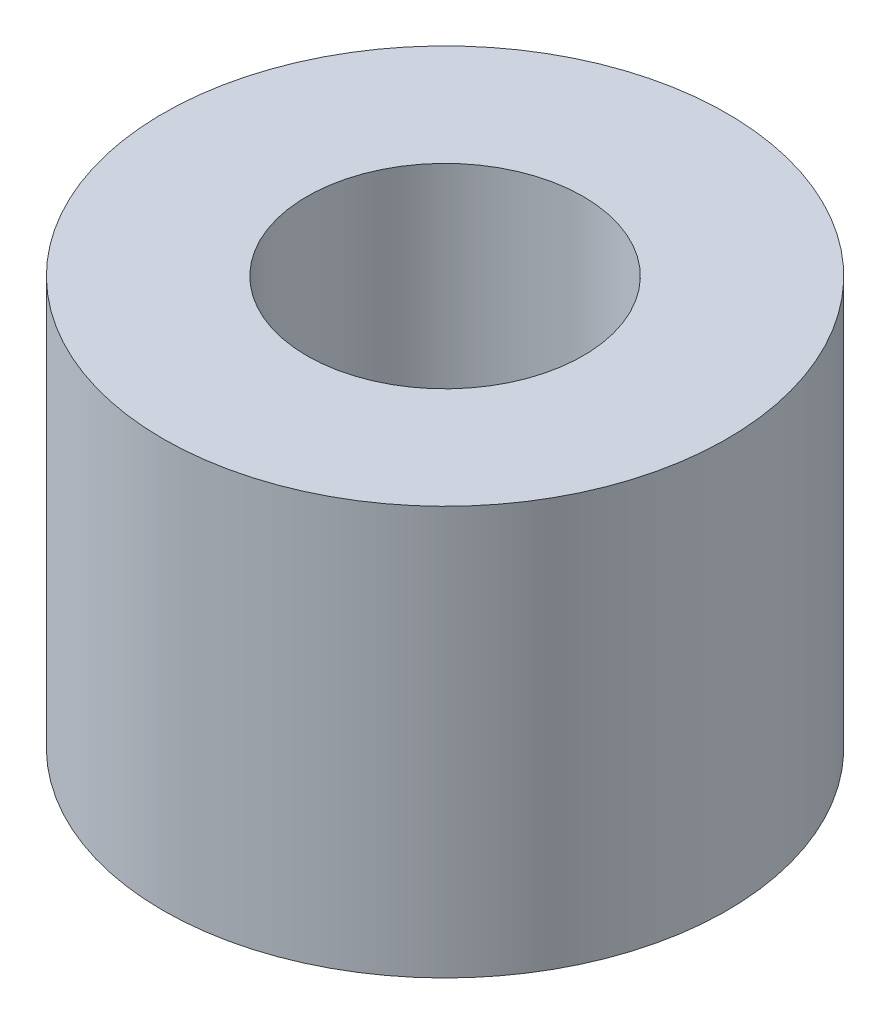
ISO-10303-21;
HEADER;
FILE_DESCRIPTION(('STEP AP214'),'2;1');
FILE_NAME('part.step','',(''),(''),'','','');
FILE_SCHEMA(('AUTOMOTIVE_DESIGN { 1 0 10303 214 1 1 1 1 }'));
ENDSEC;
DATA;
#1=APPLICATION_CONTEXT('core data for automotive mechanical design processes');
#2=APPLICATION_PROTOCOL_DEFINITION('international standard','automotive_design',2000,#1);
#3=PRODUCT_CONTEXT('',#1,'mechanical');
#4=PRODUCT('Part','Part','',(#3));
#5=PRODUCT_RELATED_PRODUCT_CATEGORY('part','',(#4));
#6=PRODUCT_DEFINITION_FORMATION('','',#4);
#7=PRODUCT_DEFINITION_CONTEXT('part definition',#1,'design');
#8=PRODUCT_DEFINITION('design','',#6,#7);
#9=PRODUCT_DEFINITION_SHAPE('','',#8);
#10=(LENGTH_UNIT() NAMED_UNIT(*) SI_UNIT(.MILLI.,.METRE.));
#11=(NAMED_UNIT(*) PLANE_ANGLE_UNIT() SI_UNIT($,.RADIAN.));
#12=(NAMED_UNIT(*) SI_UNIT($,.STERADIAN.) SOLID_ANGLE_UNIT());
#13=UNCERTAINTY_MEASURE_WITH_UNIT(LENGTH_MEASURE(1.E-05),#10,'distance_accuracy_value','');
#14=(GEOMETRIC_REPRESENTATION_CONTEXT(3) GLOBAL_UNCERTAINTY_ASSIGNED_CONTEXT((#13)) GLOBAL_UNIT_ASSIGNED_CONTEXT((#10,
#11,#12)) REPRESENTATION_CONTEXT('',''));
#15=CARTESIAN_POINT('',(0.,0.,0.));
#16=DIRECTION('',(0.,0.,1.));
#17=DIRECTION('',(1.,0.,0.));
#18=AXIS2_PLACEMENT_3D('',#15,#16,#17);
#19=CARTESIAN_POINT('',(0.,3.55,0.));
#20=DIRECTION('',(0.,1.,0.));
#21=DIRECTION('',(0.,0.,1.));
#22=AXIS2_PLACEMENT_3D('',#19,#20,#21);
#23=PLANE('',#22);
#24=CARTESIAN_POINT('',(0.,3.55,0.));
#25=DIRECTION('',(0.,1.,0.));
#26=DIRECTION('',(0.,0.,1.));
#27=AXIS2_PLACEMENT_3D('',#24,#25,#26);
#28=CIRCLE('',#27,2.45);
#29=CARTESIAN_POINT('',(0.,3.55,2.45));
#30=VERTEX_POINT('',#29);
#31=EDGE_CURVE('E10',#30,#30,#28,.T.);
#32=ORIENTED_EDGE('',*,*,#31,.T.);
#33=EDGE_LOOP('',(#32));
#34=FACE_BOUND('',#33,.T.);
#35=CARTESIAN_POINT('',(0.,3.55,0.));
#36=DIRECTION('',(0.,1.,0.));
#37=DIRECTION('',(0.,0.,1.));
#38=AXIS2_PLACEMENT_3D('',#35,#36,#37);
#39=CIRCLE('',#38,1.2);
#40=CARTESIAN_POINT('',(0.,3.55,1.2));
#41=VERTEX_POINT('',#40);
#42=EDGE_CURVE('E58',#41,#41,#39,.T.);
#43=ORIENTED_EDGE('',*,*,#42,.F.);
#44=EDGE_LOOP('',(#43));
#45=FACE_BOUND('',#44,.T.);
#46=ADVANCED_FACE('F45',(#34,#45),#23,.T.);
#47=CARTESIAN_POINT('',(0.,0.,0.));
#48=DIRECTION('',(0.,1.,0.));
#49=DIRECTION('',(0.,0.,1.));
#50=AXIS2_PLACEMENT_3D('',#47,#48,#49);
#51=PLANE('',#50);
#52=CARTESIAN_POINT('',(0.,0.,0.));
#53=DIRECTION('',(0.,1.,0.));
#54=DIRECTION('',(0.,0.,1.));
#55=AXIS2_PLACEMENT_3D('',#52,#53,#54);
#56=CIRCLE('',#55,2.45);
#57=CARTESIAN_POINT('',(0.,0.,2.45));
#58=VERTEX_POINT('',#57);
#59=EDGE_CURVE('E49',#58,#58,#56,.T.);
#60=ORIENTED_EDGE('',*,*,#59,.F.);
#61=EDGE_LOOP('',(#60));
#62=FACE_BOUND('',#61,.T.);
#63=CARTESIAN_POINT('',(0.,0.,0.));
#64=DIRECTION('',(0.,1.,0.));
#65=DIRECTION('',(0.,0.,1.));
#66=AXIS2_PLACEMENT_3D('',#63,#64,#65);
#67=CIRCLE('',#66,1.2);
#68=CARTESIAN_POINT('',(0.,0.,1.2));
#69=VERTEX_POINT('',#68);
#70=EDGE_CURVE('E60',#69,#69,#67,.T.);
#71=ORIENTED_EDGE('',*,*,#70,.T.);
#72=EDGE_LOOP('',(#71));
#73=FACE_BOUND('',#72,.T.);
#74=ADVANCED_FACE('F72',(#62,#73),#51,.F.);
#75=CARTESIAN_POINT('',(0.,3.55,0.));
#76=DIRECTION('',(0.,-1.,0.));
#77=DIRECTION('',(0.,0.,-1.));
#78=AXIS2_PLACEMENT_3D('',#75,#76,#77);
#79=CYLINDRICAL_SURFACE('',#78,2.45);
#80=ORIENTED_EDGE('',*,*,#31,.F.);
#81=EDGE_LOOP('',(#80));
#82=FACE_BOUND('',#81,.T.);
#83=ORIENTED_EDGE('',*,*,#59,.T.);
#84=EDGE_LOOP('',(#83));
#85=FACE_BOUND('',#84,.T.);
#86=ADVANCED_FACE('F47',(#82,#85),#79,.T.);
#87=CARTESIAN_POINT('',(0.,3.55,0.));
#88=DIRECTION('',(0.,-1.,0.));
#89=DIRECTION('',(0.,0.,-1.));
#90=AXIS2_PLACEMENT_3D('',#87,#88,#89);
#91=CYLINDRICAL_SURFACE('',#90,1.2);
#92=ORIENTED_EDGE('',*,*,#42,.T.);
#93=EDGE_LOOP('',(#92));
#94=FACE_BOUND('',#93,.T.);
#95=ORIENTED_EDGE('',*,*,#70,.F.);
#96=EDGE_LOOP('',(#95));
#97=FACE_BOUND('',#96,.T.);
#98=ADVANCED_FACE('F68',(#94,#97),#91,.F.);
#99=CLOSED_SHELL('',(#46,#74,#86,#98));
#100=MANIFOLD_SOLID_BREP('B2',#99);
#101=ADVANCED_BREP_SHAPE_REPRESENTATION('',(#18,#100),#14);
#102=SHAPE_DEFINITION_REPRESENTATION(#9,#101);
ENDSEC;
END-ISO-10303-21;
